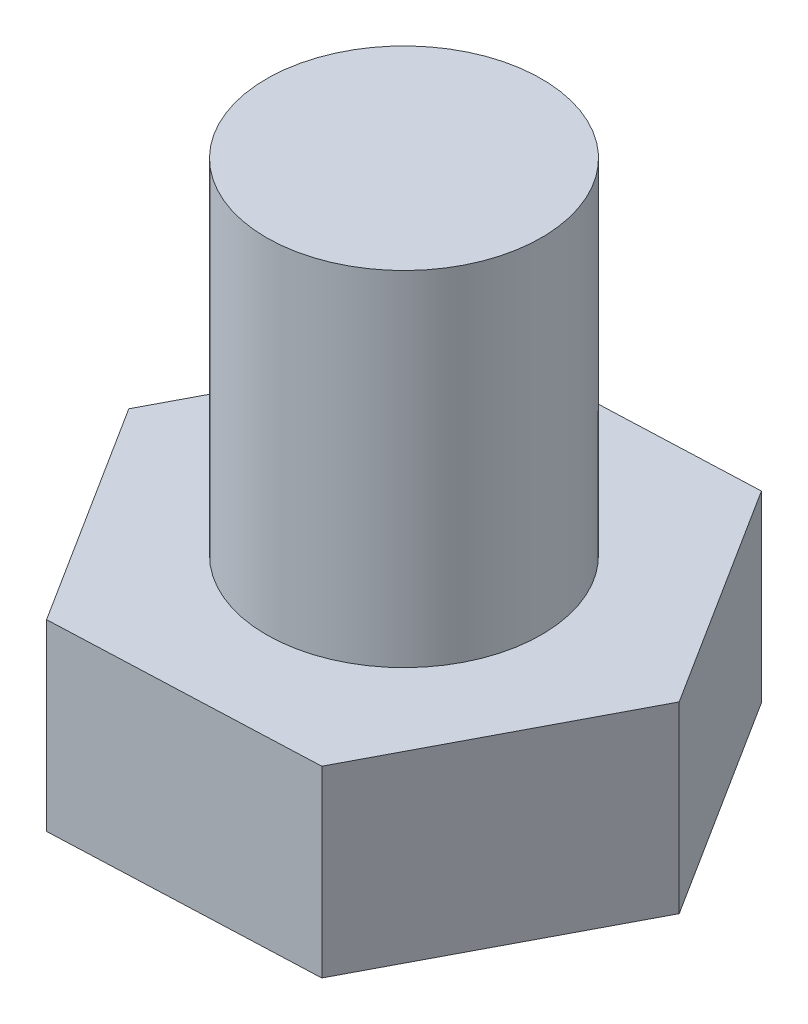
ISO-10303-21;
HEADER;
FILE_DESCRIPTION(('STEP AP214'),'2;1');
FILE_NAME('part.step','',(''),(''),'','','');
FILE_SCHEMA(('AUTOMOTIVE_DESIGN { 1 0 10303 214 1 1 1 1 }'));
ENDSEC;
DATA;
#1=APPLICATION_CONTEXT('core data for automotive mechanical design processes');
#2=APPLICATION_PROTOCOL_DEFINITION('international standard','automotive_design',2000,#1);
#3=PRODUCT_CONTEXT('',#1,'mechanical');
#4=PRODUCT('Part','Part','',(#3));
#5=PRODUCT_RELATED_PRODUCT_CATEGORY('part','',(#4));
#6=PRODUCT_DEFINITION_FORMATION('','',#4);
#7=PRODUCT_DEFINITION_CONTEXT('part definition',#1,'design');
#8=PRODUCT_DEFINITION('design','',#6,#7);
#9=PRODUCT_DEFINITION_SHAPE('','',#8);
#10=(LENGTH_UNIT() NAMED_UNIT(*) SI_UNIT(.MILLI.,.METRE.));
#11=(NAMED_UNIT(*) PLANE_ANGLE_UNIT() SI_UNIT($,.RADIAN.));
#12=(NAMED_UNIT(*) SI_UNIT($,.STERADIAN.) SOLID_ANGLE_UNIT());
#13=UNCERTAINTY_MEASURE_WITH_UNIT(LENGTH_MEASURE(1.E-05),#10,'distance_accuracy_value','');
#14=(GEOMETRIC_REPRESENTATION_CONTEXT(3) GLOBAL_UNCERTAINTY_ASSIGNED_CONTEXT((#13)) GLOBAL_UNIT_ASSIGNED_CONTEXT((#10,
#11,#12)) REPRESENTATION_CONTEXT('',''));
#15=CARTESIAN_POINT('',(0.,0.,0.));
#16=DIRECTION('',(0.,0.,1.));
#17=DIRECTION('',(1.,0.,0.));
#18=AXIS2_PLACEMENT_3D('',#15,#16,#17);
#19=CARTESIAN_POINT('',(11.5376018604348,8.,-0.465914845680283));
#20=DIRECTION('',(-0.845145434914637,0.,0.534536428920377));
#21=DIRECTION('',(0.534536428920377,0.,0.845145434914637));
#22=AXIS2_PLACEMENT_3D('',#19,#20,#21);
#23=PLANE('',#22);
#24=DIRECTION('',(-0.534536428920377,0.,-0.845145434914637));
#25=VECTOR('',#24,1.);
#26=CARTESIAN_POINT('',(11.5376018604348,0.,-0.465914845680283));
#27=LINE('',#26,#25);
#28=CARTESIAN_POINT('',(11.5376018604348,0.,-0.465914845680283));
#29=VERTEX_POINT('',#28);
#30=CARTESIAN_POINT('',(5.36530683785796,0.,-10.2248137327273));
#31=VERTEX_POINT('',#30);
#32=EDGE_CURVE('E118',#29,#31,#27,.T.);
#33=ORIENTED_EDGE('',*,*,#32,.T.);
#34=DIRECTION('',(0.,-1.,0.));
#35=VECTOR('',#34,1.);
#36=CARTESIAN_POINT('',(5.36530683785796,8.,-10.2248137327273));
#37=LINE('',#36,#35);
#38=CARTESIAN_POINT('',(5.36530683785796,8.,-10.2248137327273));
#39=VERTEX_POINT('',#38);
#40=EDGE_CURVE('E35',#39,#31,#37,.T.);
#41=ORIENTED_EDGE('',*,*,#40,.F.);
#42=DIRECTION('',(-0.534536428920377,0.,-0.845145434914637));
#43=VECTOR('',#42,1.);
#44=CARTESIAN_POINT('',(11.5376018604348,8.,-0.465914845680283));
#45=LINE('',#44,#43);
#46=CARTESIAN_POINT('',(11.5376018604348,8.,-0.465914845680283));
#47=VERTEX_POINT('',#46);
#48=EDGE_CURVE('E129',#47,#39,#45,.T.);
#49=ORIENTED_EDGE('',*,*,#48,.F.);
#50=DIRECTION('',(0.,-1.,0.));
#51=VECTOR('',#50,1.);
#52=CARTESIAN_POINT('',(11.5376018604348,8.,-0.465914845680283));
#53=LINE('',#52,#51);
#54=EDGE_CURVE('E114',#47,#29,#53,.T.);
#55=ORIENTED_EDGE('',*,*,#54,.T.);
#56=EDGE_LOOP('',(#33,#41,#49,#55));
#57=FACE_BOUND('',#56,.T.);
#58=ADVANCED_FACE('F32',(#57),#23,.F.);
#59=CARTESIAN_POINT('',(5.36530683785796,8.,-10.2248137327273));
#60=DIRECTION('',(0.0403494092359428,0.,0.999185630988712));
#61=DIRECTION('',(0.999185630988712,0.,-0.0403494092359428));
#62=AXIS2_PLACEMENT_3D('',#59,#60,#61);
#63=PLANE('',#62);
#64=DIRECTION('',(-0.999185630988712,0.,0.0403494092359428));
#65=VECTOR('',#64,1.);
#66=CARTESIAN_POINT('',(5.36530683785796,0.,-10.2248137327273));
#67=LINE('',#66,#65);
#68=CARTESIAN_POINT('',(-6.17229502257682,0.,-9.75889888704698));
#69=VERTEX_POINT('',#68);
#70=EDGE_CURVE('E121',#31,#69,#67,.T.);
#71=ORIENTED_EDGE('',*,*,#70,.T.);
#72=DIRECTION('',(0.,-1.,0.));
#73=VECTOR('',#72,1.);
#74=CARTESIAN_POINT('',(-6.17229502257682,8.,-9.75889888704698));
#75=LINE('',#74,#73);
#76=CARTESIAN_POINT('',(-6.17229502257682,8.,-9.75889888704698));
#77=VERTEX_POINT('',#76);
#78=EDGE_CURVE('E132',#77,#69,#75,.T.);
#79=ORIENTED_EDGE('',*,*,#78,.F.);
#80=DIRECTION('',(-0.999185630988712,0.,0.0403494092359428));
#81=VECTOR('',#80,1.);
#82=CARTESIAN_POINT('',(5.36530683785796,8.,-10.2248137327273));
#83=LINE('',#82,#81);
#84=EDGE_CURVE('E87',#39,#77,#83,.T.);
#85=ORIENTED_EDGE('',*,*,#84,.F.);
#86=ORIENTED_EDGE('',*,*,#40,.T.);
#87=EDGE_LOOP('',(#71,#79,#85,#86));
#88=FACE_BOUND('',#87,.T.);
#89=ADVANCED_FACE('F137',(#88),#63,.F.);
#90=CARTESIAN_POINT('',(-6.17229502257682,8.,-9.75889888704698));
#91=DIRECTION('',(0.88549484415058,0.,0.464649202068335));
#92=DIRECTION('',(0.464649202068335,0.,-0.88549484415058));
#93=AXIS2_PLACEMENT_3D('',#90,#91,#92);
#94=PLANE('',#93);
#95=DIRECTION('',(-0.464649202068335,0.,0.88549484415058));
#96=VECTOR('',#95,1.);
#97=CARTESIAN_POINT('',(-6.17229502257682,0.,-9.75889888704698));
#98=LINE('',#97,#96);
#99=CARTESIAN_POINT('',(-11.5376018604348,0.,0.46591484568028));
#100=VERTEX_POINT('',#99);
#101=EDGE_CURVE('E124',#69,#100,#98,.T.);
#102=ORIENTED_EDGE('',*,*,#101,.T.);
#103=DIRECTION('',(0.,-1.,0.));
#104=VECTOR('',#103,1.);
#105=CARTESIAN_POINT('',(-11.5376018604348,8.,0.46591484568028));
#106=LINE('',#105,#104);
#107=CARTESIAN_POINT('',(-11.5376018604348,8.,0.46591484568028));
#108=VERTEX_POINT('',#107);
#109=EDGE_CURVE('E109',#108,#100,#106,.T.);
#110=ORIENTED_EDGE('',*,*,#109,.F.);
#111=DIRECTION('',(-0.464649202068335,0.,0.88549484415058));
#112=VECTOR('',#111,1.);
#113=CARTESIAN_POINT('',(-6.17229502257682,8.,-9.75889888704698));
#114=LINE('',#113,#112);
#115=EDGE_CURVE('E100',#77,#108,#114,.T.);
#116=ORIENTED_EDGE('',*,*,#115,.F.);
#117=ORIENTED_EDGE('',*,*,#78,.T.);
#118=EDGE_LOOP('',(#102,#110,#116,#117));
#119=FACE_BOUND('',#118,.T.);
#120=ADVANCED_FACE('F143',(#119),#94,.F.);
#121=CARTESIAN_POINT('',(-11.5376018604348,8.,0.46591484568028));
#122=DIRECTION('',(0.845145434914637,0.,-0.534536428920377));
#123=DIRECTION('',(-0.534536428920377,0.,-0.845145434914637));
#124=AXIS2_PLACEMENT_3D('',#121,#122,#123);
#125=PLANE('',#124);
#126=DIRECTION('',(0.534536428920377,0.,0.845145434914637));
#127=VECTOR('',#126,1.);
#128=CARTESIAN_POINT('',(-11.5376018604348,0.,0.46591484568028));
#129=LINE('',#128,#127);
#130=CARTESIAN_POINT('',(-5.36530683785796,0.,10.2248137327273));
#131=VERTEX_POINT('',#130);
#132=EDGE_CURVE('E108',#100,#131,#129,.T.);
#133=ORIENTED_EDGE('',*,*,#132,.T.);
#134=DIRECTION('',(0.,-1.,0.));
#135=VECTOR('',#134,1.);
#136=CARTESIAN_POINT('',(-5.36530683785796,8.,10.2248137327273));
#137=LINE('',#136,#135);
#138=CARTESIAN_POINT('',(-5.36530683785796,8.,10.2248137327273));
#139=VERTEX_POINT('',#138);
#140=EDGE_CURVE('E105',#139,#131,#137,.T.);
#141=ORIENTED_EDGE('',*,*,#140,.F.);
#142=DIRECTION('',(0.534536428920377,0.,0.845145434914637));
#143=VECTOR('',#142,1.);
#144=CARTESIAN_POINT('',(-11.5376018604348,8.,0.46591484568028));
#145=LINE('',#144,#143);
#146=EDGE_CURVE('E94',#108,#139,#145,.T.);
#147=ORIENTED_EDGE('',*,*,#146,.F.);
#148=ORIENTED_EDGE('',*,*,#109,.T.);
#149=EDGE_LOOP('',(#133,#141,#147,#148));
#150=FACE_BOUND('',#149,.T.);
#151=ADVANCED_FACE('F106',(#150),#125,.F.);
#152=CARTESIAN_POINT('',(-5.36530683785796,8.,10.2248137327273));
#153=DIRECTION('',(-0.040349409235943,0.,-0.999185630988712));
#154=DIRECTION('',(-0.999185630988712,0.,0.0403494092359429));
#155=AXIS2_PLACEMENT_3D('',#152,#153,#154);
#156=PLANE('',#155);
#157=DIRECTION('',(0.999185630988712,0.,-0.0403494092359429));
#158=VECTOR('',#157,1.);
#159=CARTESIAN_POINT('',(-5.36530683785796,0.,10.2248137327273));
#160=LINE('',#159,#158);
#161=CARTESIAN_POINT('',(6.17229502257682,0.,9.75889888704698));
#162=VERTEX_POINT('',#161);
#163=EDGE_CURVE('E72',#131,#162,#160,.T.);
#164=ORIENTED_EDGE('',*,*,#163,.T.);
#165=DIRECTION('',(0.,-1.,0.));
#166=VECTOR('',#165,1.);
#167=CARTESIAN_POINT('',(6.17229502257682,8.,9.75889888704698));
#168=LINE('',#167,#166);
#169=CARTESIAN_POINT('',(6.17229502257682,8.,9.75889888704698));
#170=VERTEX_POINT('',#169);
#171=EDGE_CURVE('E110',#170,#162,#168,.T.);
#172=ORIENTED_EDGE('',*,*,#171,.F.);
#173=DIRECTION('',(0.999185630988712,0.,-0.0403494092359429));
#174=VECTOR('',#173,1.);
#175=CARTESIAN_POINT('',(-5.36530683785796,8.,10.2248137327273));
#176=LINE('',#175,#174);
#177=EDGE_CURVE('E98',#139,#170,#176,.T.);
#178=ORIENTED_EDGE('',*,*,#177,.F.);
#179=ORIENTED_EDGE('',*,*,#140,.T.);
#180=EDGE_LOOP('',(#164,#172,#178,#179));
#181=FACE_BOUND('',#180,.T.);
#182=ADVANCED_FACE('F112',(#181),#156,.F.);
#183=CARTESIAN_POINT('',(6.17229502257682,8.,9.75889888704698));
#184=DIRECTION('',(-0.88549484415058,0.,-0.464649202068335));
#185=DIRECTION('',(-0.464649202068335,0.,0.88549484415058));
#186=AXIS2_PLACEMENT_3D('',#183,#184,#185);
#187=PLANE('',#186);
#188=DIRECTION('',(0.464649202068335,0.,-0.88549484415058));
#189=VECTOR('',#188,1.);
#190=CARTESIAN_POINT('',(6.17229502257682,0.,9.75889888704698));
#191=LINE('',#190,#189);
#192=EDGE_CURVE('E78',#162,#29,#191,.T.);
#193=ORIENTED_EDGE('',*,*,#192,.T.);
#194=ORIENTED_EDGE('',*,*,#54,.F.);
#195=DIRECTION('',(0.464649202068335,0.,-0.88549484415058));
#196=VECTOR('',#195,1.);
#197=CARTESIAN_POINT('',(6.17229502257682,8.,9.75889888704698));
#198=LINE('',#197,#196);
#199=EDGE_CURVE('E49',#170,#47,#198,.T.);
#200=ORIENTED_EDGE('',*,*,#199,.F.);
#201=ORIENTED_EDGE('',*,*,#171,.T.);
#202=EDGE_LOOP('',(#193,#194,#200,#201));
#203=FACE_BOUND('',#202,.T.);
#204=ADVANCED_FACE('F159',(#203),#187,.F.);
#205=CARTESIAN_POINT('',(0.,8.,0.));
#206=DIRECTION('',(0.,1.,0.));
#207=DIRECTION('',(0.,0.,1.));
#208=AXIS2_PLACEMENT_3D('',#205,#206,#207);
#209=PLANE('',#208);
#210=CARTESIAN_POINT('',(0.,8.,0.));
#211=DIRECTION('',(0.,1.,0.));
#212=DIRECTION('',(0.,0.,1.));
#213=AXIS2_PLACEMENT_3D('',#210,#211,#212);
#214=CIRCLE('',#213,6.);
#215=CARTESIAN_POINT('',(0.,8.,6.));
#216=VERTEX_POINT('',#215);
#217=EDGE_CURVE('E11',#216,#216,#214,.T.);
#218=ORIENTED_EDGE('',*,*,#217,.F.);
#219=EDGE_LOOP('',(#218));
#220=FACE_BOUND('',#219,.T.);
#221=ORIENTED_EDGE('',*,*,#48,.T.);
#222=ORIENTED_EDGE('',*,*,#84,.T.);
#223=ORIENTED_EDGE('',*,*,#115,.T.);
#224=ORIENTED_EDGE('',*,*,#146,.T.);
#225=ORIENTED_EDGE('',*,*,#177,.T.);
#226=ORIENTED_EDGE('',*,*,#199,.T.);
#227=EDGE_LOOP('',(#221,#222,#223,#224,#225,#226));
#228=FACE_BOUND('',#227,.T.);
#229=ADVANCED_FACE('F96',(#220,#228),#209,.T.);
#230=CARTESIAN_POINT('',(0.,0.,0.));
#231=DIRECTION('',(0.,1.,0.));
#232=DIRECTION('',(0.,0.,1.));
#233=AXIS2_PLACEMENT_3D('',#230,#231,#232);
#234=PLANE('',#233);
#235=ORIENTED_EDGE('',*,*,#32,.F.);
#236=ORIENTED_EDGE('',*,*,#192,.F.);
#237=ORIENTED_EDGE('',*,*,#163,.F.);
#238=ORIENTED_EDGE('',*,*,#132,.F.);
#239=ORIENTED_EDGE('',*,*,#101,.F.);
#240=ORIENTED_EDGE('',*,*,#70,.F.);
#241=EDGE_LOOP('',(#235,#236,#237,#238,#239,#240));
#242=FACE_BOUND('',#241,.T.);
#243=ADVANCED_FACE('F142',(#242),#234,.F.);
#244=CARTESIAN_POINT('',(0.,23.,0.));
#245=DIRECTION('',(0.,-1.,0.));
#246=DIRECTION('',(0.,0.,-1.));
#247=AXIS2_PLACEMENT_3D('',#244,#245,#246);
#248=CYLINDRICAL_SURFACE('',#247,6.);
#249=CARTESIAN_POINT('',(0.,23.,0.));
#250=DIRECTION('',(0.,1.,0.));
#251=DIRECTION('',(0.,0.,1.));
#252=AXIS2_PLACEMENT_3D('',#249,#250,#251);
#253=CIRCLE('',#252,6.);
#254=CARTESIAN_POINT('',(0.,23.,6.));
#255=VERTEX_POINT('',#254);
#256=EDGE_CURVE('E122',#255,#255,#253,.T.);
#257=ORIENTED_EDGE('',*,*,#256,.F.);
#258=EDGE_LOOP('',(#257));
#259=FACE_BOUND('',#258,.T.);
#260=ORIENTED_EDGE('',*,*,#217,.T.);
#261=EDGE_LOOP('',(#260));
#262=FACE_BOUND('',#261,.T.);
#263=ADVANCED_FACE('F152',(#259,#262),#248,.T.);
#264=CARTESIAN_POINT('',(0.,23.,0.));
#265=DIRECTION('',(0.,1.,0.));
#266=DIRECTION('',(0.,0.,1.));
#267=AXIS2_PLACEMENT_3D('',#264,#265,#266);
#268=PLANE('',#267);
#269=ORIENTED_EDGE('',*,*,#256,.T.);
#270=EDGE_LOOP('',(#269));
#271=FACE_BOUND('',#270,.T.);
#272=ADVANCED_FACE('F150',(#271),#268,.T.);
#273=CLOSED_SHELL('',(#58,#89,#120,#151,#182,#204,#229,#243,#263,#272));
#274=MANIFOLD_SOLID_BREP('B2',#273);
#275=ADVANCED_BREP_SHAPE_REPRESENTATION('',(#18,#274),#14);
#276=SHAPE_DEFINITION_REPRESENTATION(#9,#275);
ENDSEC;
END-ISO-10303-21;
